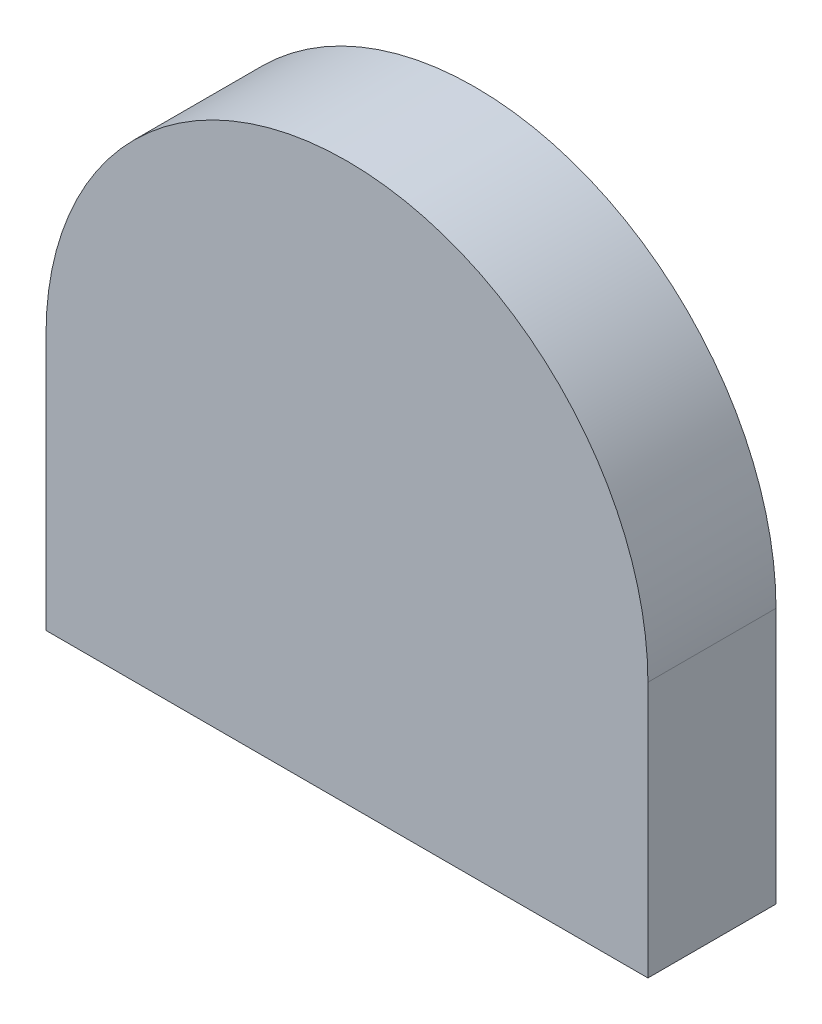
ISO-10303-21;
HEADER;
FILE_DESCRIPTION(('STEP AP214'),'2;1');
FILE_NAME('part.step','',(''),(''),'','','');
FILE_SCHEMA(('AUTOMOTIVE_DESIGN { 1 0 10303 214 1 1 1 1 }'));
ENDSEC;
DATA;
#1=APPLICATION_CONTEXT('core data for automotive mechanical design processes');
#2=APPLICATION_PROTOCOL_DEFINITION('international standard','automotive_design',2000,#1);
#3=PRODUCT_CONTEXT('',#1,'mechanical');
#4=PRODUCT('Part','Part','',(#3));
#5=PRODUCT_RELATED_PRODUCT_CATEGORY('part','',(#4));
#6=PRODUCT_DEFINITION_FORMATION('','',#4);
#7=PRODUCT_DEFINITION_CONTEXT('part definition',#1,'design');
#8=PRODUCT_DEFINITION('design','',#6,#7);
#9=PRODUCT_DEFINITION_SHAPE('','',#8);
#10=(LENGTH_UNIT() NAMED_UNIT(*) SI_UNIT(.MILLI.,.METRE.));
#11=(NAMED_UNIT(*) PLANE_ANGLE_UNIT() SI_UNIT($,.RADIAN.));
#12=(NAMED_UNIT(*) SI_UNIT($,.STERADIAN.) SOLID_ANGLE_UNIT());
#13=UNCERTAINTY_MEASURE_WITH_UNIT(LENGTH_MEASURE(1.E-05),#10,'distance_accuracy_value','');
#14=(GEOMETRIC_REPRESENTATION_CONTEXT(3) GLOBAL_UNCERTAINTY_ASSIGNED_CONTEXT((#13)) GLOBAL_UNIT_ASSIGNED_CONTEXT((#10,
#11,#12)) REPRESENTATION_CONTEXT('',''));
#15=CARTESIAN_POINT('',(0.,0.,0.));
#16=DIRECTION('',(0.,0.,1.));
#17=DIRECTION('',(1.,0.,0.));
#18=AXIS2_PLACEMENT_3D('',#15,#16,#17);
#19=CARTESIAN_POINT('',(0.,0.,10.));
#20=DIRECTION('',(1.,0.,0.));
#21=DIRECTION('',(0.,0.,-1.));
#22=AXIS2_PLACEMENT_3D('',#19,#20,#21);
#23=PLANE('',#22);
#24=DIRECTION('',(0.,-1.,0.));
#25=VECTOR('',#24,1.);
#26=CARTESIAN_POINT('',(0.,0.,0.));
#27=LINE('',#26,#25);
#28=CARTESIAN_POINT('',(0.,20.,0.));
#29=VERTEX_POINT('',#28);
#30=CARTESIAN_POINT('',(0.,0.,0.));
#31=VERTEX_POINT('',#30);
#32=EDGE_CURVE('E107',#29,#31,#27,.T.);
#33=ORIENTED_EDGE('',*,*,#32,.T.);
#34=DIRECTION('',(0.,0.,-1.));
#35=VECTOR('',#34,1.);
#36=CARTESIAN_POINT('',(0.,0.,10.));
#37=LINE('',#36,#35);
#38=CARTESIAN_POINT('',(0.,0.,10.));
#39=VERTEX_POINT('',#38);
#40=EDGE_CURVE('E11',#39,#31,#37,.T.);
#41=ORIENTED_EDGE('',*,*,#40,.F.);
#42=DIRECTION('',(0.,-1.,0.));
#43=VECTOR('',#42,1.);
#44=CARTESIAN_POINT('',(0.,0.,10.));
#45=LINE('',#44,#43);
#46=CARTESIAN_POINT('',(0.,20.,10.));
#47=VERTEX_POINT('',#46);
#48=EDGE_CURVE('E91',#47,#39,#45,.T.);
#49=ORIENTED_EDGE('',*,*,#48,.F.);
#50=DIRECTION('',(0.,0.,-1.));
#51=VECTOR('',#50,1.);
#52=CARTESIAN_POINT('',(0.,20.,10.));
#53=LINE('',#52,#51);
#54=EDGE_CURVE('E103',#47,#29,#53,.T.);
#55=ORIENTED_EDGE('',*,*,#54,.T.);
#56=EDGE_LOOP('',(#33,#41,#49,#55));
#57=FACE_BOUND('',#56,.T.);
#58=ADVANCED_FACE('F39',(#57),#23,.F.);
#59=CARTESIAN_POINT('',(0.,0.,10.));
#60=DIRECTION('',(0.,1.,0.));
#61=DIRECTION('',(0.,0.,1.));
#62=AXIS2_PLACEMENT_3D('',#59,#60,#61);
#63=PLANE('',#62);
#64=DIRECTION('',(1.,0.,0.));
#65=VECTOR('',#64,1.);
#66=CARTESIAN_POINT('',(0.,0.,0.));
#67=LINE('',#66,#65);
#68=CARTESIAN_POINT('',(47.,0.,0.));
#69=VERTEX_POINT('',#68);
#70=EDGE_CURVE('E96',#31,#69,#67,.T.);
#71=ORIENTED_EDGE('',*,*,#70,.T.);
#72=DIRECTION('',(0.,0.,-1.));
#73=VECTOR('',#72,1.);
#74=CARTESIAN_POINT('',(47.,0.,10.));
#75=LINE('',#74,#73);
#76=CARTESIAN_POINT('',(47.,0.,10.));
#77=VERTEX_POINT('',#76);
#78=EDGE_CURVE('E48',#77,#69,#75,.T.);
#79=ORIENTED_EDGE('',*,*,#78,.F.);
#80=DIRECTION('',(1.,0.,0.));
#81=VECTOR('',#80,1.);
#82=CARTESIAN_POINT('',(0.,0.,10.));
#83=LINE('',#82,#81);
#84=EDGE_CURVE('E86',#39,#77,#83,.T.);
#85=ORIENTED_EDGE('',*,*,#84,.F.);
#86=ORIENTED_EDGE('',*,*,#40,.T.);
#87=EDGE_LOOP('',(#71,#79,#85,#86));
#88=FACE_BOUND('',#87,.T.);
#89=ADVANCED_FACE('F95',(#88),#63,.F.);
#90=CARTESIAN_POINT('',(47.,0.,10.));
#91=DIRECTION('',(-1.,0.,0.));
#92=DIRECTION('',(0.,0.,1.));
#93=AXIS2_PLACEMENT_3D('',#90,#91,#92);
#94=PLANE('',#93);
#95=DIRECTION('',(0.,1.,0.));
#96=VECTOR('',#95,1.);
#97=CARTESIAN_POINT('',(47.,0.,0.));
#98=LINE('',#97,#96);
#99=CARTESIAN_POINT('',(47.,20.,0.));
#100=VERTEX_POINT('',#99);
#101=EDGE_CURVE('E73',#69,#100,#98,.T.);
#102=ORIENTED_EDGE('',*,*,#101,.T.);
#103=DIRECTION('',(0.,0.,-1.));
#104=VECTOR('',#103,1.);
#105=CARTESIAN_POINT('',(47.,20.,10.));
#106=LINE('',#105,#104);
#107=CARTESIAN_POINT('',(47.,20.,10.));
#108=VERTEX_POINT('',#107);
#109=EDGE_CURVE('E98',#108,#100,#106,.T.);
#110=ORIENTED_EDGE('',*,*,#109,.F.);
#111=DIRECTION('',(0.,1.,0.));
#112=VECTOR('',#111,1.);
#113=CARTESIAN_POINT('',(47.,0.,10.));
#114=LINE('',#113,#112);
#115=EDGE_CURVE('E89',#77,#108,#114,.T.);
#116=ORIENTED_EDGE('',*,*,#115,.F.);
#117=ORIENTED_EDGE('',*,*,#78,.T.);
#118=EDGE_LOOP('',(#102,#110,#116,#117));
#119=FACE_BOUND('',#118,.T.);
#120=ADVANCED_FACE('F99',(#119),#94,.F.);
#121=CARTESIAN_POINT('',(23.5,20.,10.));
#122=DIRECTION('',(0.,0.,-1.));
#123=DIRECTION('',(-1.,0.,0.));
#124=AXIS2_PLACEMENT_3D('',#121,#122,#123);
#125=CYLINDRICAL_SURFACE('',#124,23.5);
#126=CARTESIAN_POINT('',(23.5,20.,0.));
#127=DIRECTION('',(0.,0.,1.));
#128=DIRECTION('',(-1.,0.,0.));
#129=AXIS2_PLACEMENT_3D('',#126,#127,#128);
#130=CIRCLE('',#129,23.5);
#131=EDGE_CURVE('E79',#100,#29,#130,.T.);
#132=ORIENTED_EDGE('',*,*,#131,.T.);
#133=ORIENTED_EDGE('',*,*,#54,.F.);
#134=CARTESIAN_POINT('',(23.5,20.,10.));
#135=DIRECTION('',(0.,0.,1.));
#136=DIRECTION('',(-1.,0.,0.));
#137=AXIS2_PLACEMENT_3D('',#134,#135,#136);
#138=CIRCLE('',#137,23.5);
#139=EDGE_CURVE('E56',#108,#47,#138,.T.);
#140=ORIENTED_EDGE('',*,*,#139,.F.);
#141=ORIENTED_EDGE('',*,*,#109,.T.);
#142=EDGE_LOOP('',(#132,#133,#140,#141));
#143=FACE_BOUND('',#142,.T.);
#144=ADVANCED_FACE('F120',(#143),#125,.T.);
#145=CARTESIAN_POINT('',(23.5,20.,10.));
#146=DIRECTION('',(0.,0.,-1.));
#147=DIRECTION('',(-1.,0.,0.));
#148=AXIS2_PLACEMENT_3D('',#145,#146,#147);
#149=PLANE('',#148);
#150=ORIENTED_EDGE('',*,*,#48,.T.);
#151=ORIENTED_EDGE('',*,*,#84,.T.);
#152=ORIENTED_EDGE('',*,*,#115,.T.);
#153=ORIENTED_EDGE('',*,*,#139,.T.);
#154=EDGE_LOOP('',(#150,#151,#152,#153));
#155=FACE_BOUND('',#154,.T.);
#156=ADVANCED_FACE('F87',(#155),#149,.F.);
#157=CARTESIAN_POINT('',(23.5,20.,0.));
#158=DIRECTION('',(0.,0.,-1.));
#159=DIRECTION('',(-1.,0.,0.));
#160=AXIS2_PLACEMENT_3D('',#157,#158,#159);
#161=PLANE('',#160);
#162=ORIENTED_EDGE('',*,*,#32,.F.);
#163=ORIENTED_EDGE('',*,*,#131,.F.);
#164=ORIENTED_EDGE('',*,*,#101,.F.);
#165=ORIENTED_EDGE('',*,*,#70,.F.);
#166=EDGE_LOOP('',(#162,#163,#164,#165));
#167=FACE_BOUND('',#166,.T.);
#168=ADVANCED_FACE('F123',(#167),#161,.T.);
#169=CLOSED_SHELL('',(#58,#89,#120,#144,#156,#168));
#170=MANIFOLD_SOLID_BREP('B2',#169);
#171=ADVANCED_BREP_SHAPE_REPRESENTATION('',(#18,#170),#14);
#172=SHAPE_DEFINITION_REPRESENTATION(#9,#171);
ENDSEC;
END-ISO-10303-21;
